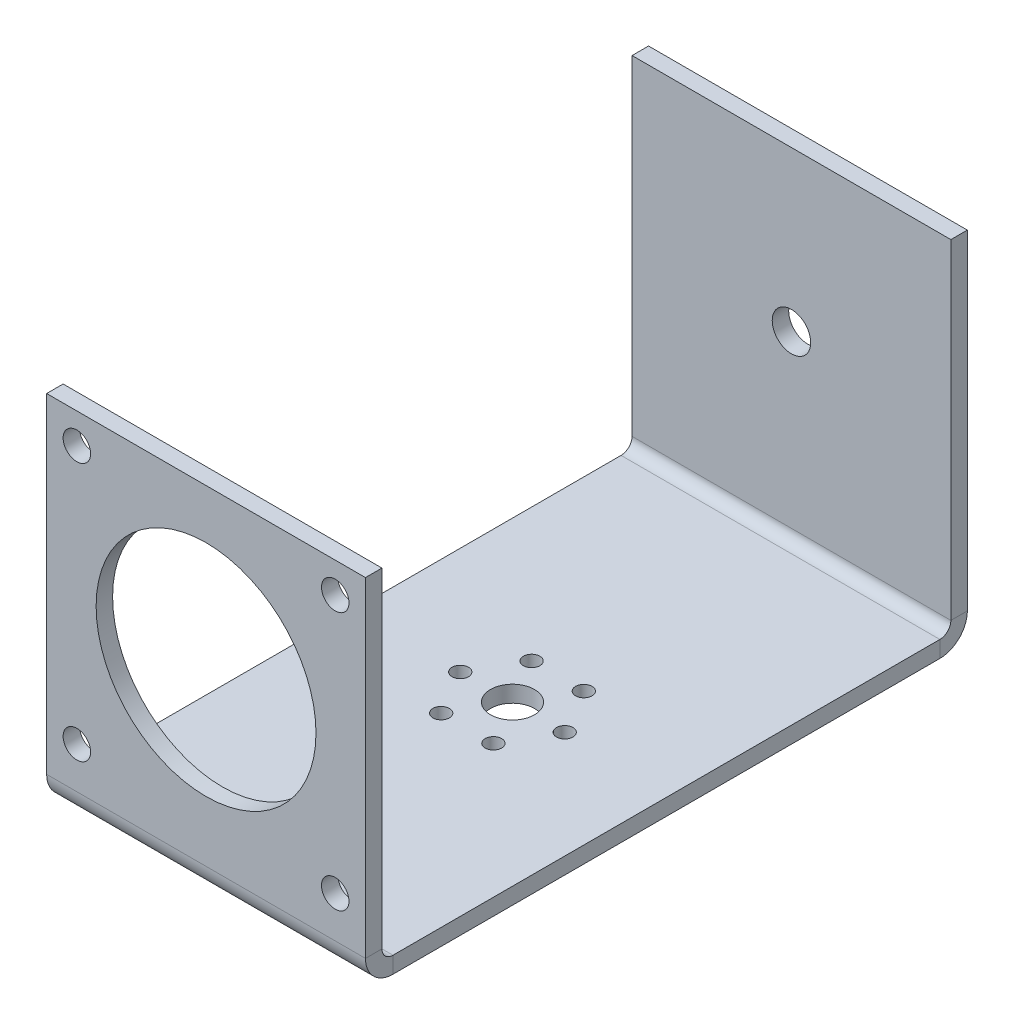
ISO-10303-21;
HEADER;
FILE_DESCRIPTION(('STEP AP214'),'2;1');
FILE_NAME('part.step','',(''),(''),'','','');
FILE_SCHEMA(('AUTOMOTIVE_DESIGN { 1 0 10303 214 1 1 1 1 }'));
ENDSEC;
DATA;
#1=APPLICATION_CONTEXT('core data for automotive mechanical design processes');
#2=APPLICATION_PROTOCOL_DEFINITION('international standard','automotive_design',2000,#1);
#3=PRODUCT_CONTEXT('',#1,'mechanical');
#4=PRODUCT('Part','Part','',(#3));
#5=PRODUCT_RELATED_PRODUCT_CATEGORY('part','',(#4));
#6=PRODUCT_DEFINITION_FORMATION('','',#4);
#7=PRODUCT_DEFINITION_CONTEXT('part definition',#1,'design');
#8=PRODUCT_DEFINITION('design','',#6,#7);
#9=PRODUCT_DEFINITION_SHAPE('','',#8);
#10=(LENGTH_UNIT() NAMED_UNIT(*) SI_UNIT(.MILLI.,.METRE.));
#11=(NAMED_UNIT(*) PLANE_ANGLE_UNIT() SI_UNIT($,.RADIAN.));
#12=(NAMED_UNIT(*) SI_UNIT($,.STERADIAN.) SOLID_ANGLE_UNIT());
#13=UNCERTAINTY_MEASURE_WITH_UNIT(LENGTH_MEASURE(1.E-05),#10,'distance_accuracy_value','');
#14=(GEOMETRIC_REPRESENTATION_CONTEXT(3) GLOBAL_UNCERTAINTY_ASSIGNED_CONTEXT((#13)) GLOBAL_UNIT_ASSIGNED_CONTEXT((#10,
#11,#12)) REPRESENTATION_CONTEXT('',''));
#15=CARTESIAN_POINT('',(0.,0.,0.));
#16=DIRECTION('',(0.,0.,1.));
#17=DIRECTION('',(1.,0.,0.));
#18=AXIS2_PLACEMENT_3D('',#15,#16,#17);
#19=CARTESIAN_POINT('',(0.,-31.5991903846266,0.));
#20=DIRECTION('',(1.,0.,0.));
#21=DIRECTION('',(0.,0.,1.));
#22=AXIS2_PLACEMENT_3D('',#19,#20,#21);
#23=PLANE('',#22);
#24=DIRECTION('',(0.,1.,0.));
#25=VECTOR('',#24,1.);
#26=CARTESIAN_POINT('',(0.,-31.5991903846266,-28.1483281173427));
#27=LINE('',#26,#25);
#28=CARTESIAN_POINT('',(0.,-34.5991903846266,-28.1483281173427));
#29=VERTEX_POINT('',#28);
#30=CARTESIAN_POINT('',(0.,-31.5991903846266,-28.1483281173427));
#31=VERTEX_POINT('',#30);
#32=EDGE_CURVE('E11',#29,#31,#27,.T.);
#33=ORIENTED_EDGE('',*,*,#32,.F.);
#34=DIRECTION('',(0.,0.,-1.));
#35=VECTOR('',#34,1.);
#36=CARTESIAN_POINT('',(0.,-34.5991903846266,73.3516718826573));
#37=LINE('',#36,#35);
#38=CARTESIAN_POINT('',(0.,-34.5991903846266,71.3516718826573));
#39=VERTEX_POINT('',#38);
#40=EDGE_CURVE('E99',#29,#39,#37,.F.);
#41=ORIENTED_EDGE('',*,*,#40,.T.);
#42=DIRECTION('',(0.,1.,0.));
#43=VECTOR('',#42,1.);
#44=CARTESIAN_POINT('',(0.,-31.5991903846266,71.3516718826573));
#45=LINE('',#44,#43);
#46=CARTESIAN_POINT('',(0.,-31.5991903846266,71.3516718826573));
#47=VERTEX_POINT('',#46);
#48=EDGE_CURVE('E47',#39,#47,#45,.T.);
#49=ORIENTED_EDGE('',*,*,#48,.T.);
#50=DIRECTION('',(0.,0.,1.));
#51=VECTOR('',#50,1.);
#52=CARTESIAN_POINT('',(0.,-31.5991903846266,0.));
#53=LINE('',#52,#51);
#54=EDGE_CURVE('E102',#31,#47,#53,.T.);
#55=ORIENTED_EDGE('',*,*,#54,.F.);
#56=EDGE_LOOP('',(#33,#41,#49,#55));
#57=FACE_BOUND('',#56,.T.);
#58=ADVANCED_FACE('F37',(#57),#23,.F.);
#59=CARTESIAN_POINT('',(0.,-29.5991903846266,71.3516718826573));
#60=DIRECTION('',(-1.,0.,0.));
#61=DIRECTION('',(0.,0.,1.));
#62=AXIS2_PLACEMENT_3D('',#59,#60,#61);
#63=PLANE('',#62);
#64=ORIENTED_EDGE('',*,*,#48,.F.);
#65=CARTESIAN_POINT('',(0.,-29.5991903846266,71.3516718826573));
#66=DIRECTION('',(-1.,0.,0.));
#67=DIRECTION('',(0.,0.,1.));
#68=AXIS2_PLACEMENT_3D('',#65,#66,#67);
#69=CIRCLE('',#68,5.);
#70=CARTESIAN_POINT('',(0.,-29.5991903846266,76.3516718826573));
#71=VERTEX_POINT('',#70);
#72=EDGE_CURVE('E142',#39,#71,#69,.T.);
#73=ORIENTED_EDGE('',*,*,#72,.T.);
#74=DIRECTION('',(0.,0.,-1.));
#75=VECTOR('',#74,1.);
#76=CARTESIAN_POINT('',(0.,-29.5991903846266,73.3516718826573));
#77=LINE('',#76,#75);
#78=CARTESIAN_POINT('',(0.,-29.5991903846266,73.3516718826573));
#79=VERTEX_POINT('',#78);
#80=EDGE_CURVE('E185',#71,#79,#77,.T.);
#81=ORIENTED_EDGE('',*,*,#80,.T.);
#82=CARTESIAN_POINT('',(0.,-29.5991903846266,71.3516718826573));
#83=DIRECTION('',(1.,0.,0.));
#84=DIRECTION('',(0.,0.,-1.));
#85=AXIS2_PLACEMENT_3D('',#82,#83,#84);
#86=CIRCLE('',#85,2.);
#87=EDGE_CURVE('E204',#47,#79,#86,.F.);
#88=ORIENTED_EDGE('',*,*,#87,.F.);
#89=EDGE_LOOP('',(#64,#73,#81,#88));
#90=FACE_BOUND('',#89,.T.);
#91=ADVANCED_FACE('F205',(#90),#63,.T.);
#92=CARTESIAN_POINT('',(0.,30.4008096153734,73.3516718826573));
#93=DIRECTION('',(1.,0.,0.));
#94=DIRECTION('',(0.,1.,0.));
#95=AXIS2_PLACEMENT_3D('',#92,#93,#94);
#96=PLANE('',#95);
#97=ORIENTED_EDGE('',*,*,#80,.F.);
#98=DIRECTION('',(0.,-1.,0.));
#99=VECTOR('',#98,1.);
#100=CARTESIAN_POINT('',(0.,30.4008096153734,76.3516718826573));
#101=LINE('',#100,#99);
#102=CARTESIAN_POINT('',(0.,30.4008096153734,76.3516718826573));
#103=VERTEX_POINT('',#102);
#104=EDGE_CURVE('E162',#71,#103,#101,.F.);
#105=ORIENTED_EDGE('',*,*,#104,.T.);
#106=DIRECTION('',(0.,0.,-1.));
#107=VECTOR('',#106,1.);
#108=CARTESIAN_POINT('',(0.,30.4008096153734,73.3516718826573));
#109=LINE('',#108,#107);
#110=CARTESIAN_POINT('',(0.,30.4008096153734,73.3516718826573));
#111=VERTEX_POINT('',#110);
#112=EDGE_CURVE('E182',#103,#111,#109,.T.);
#113=ORIENTED_EDGE('',*,*,#112,.T.);
#114=DIRECTION('',(0.,1.,0.));
#115=VECTOR('',#114,1.);
#116=CARTESIAN_POINT('',(0.,30.4008096153734,73.3516718826573));
#117=LINE('',#116,#115);
#118=EDGE_CURVE('E263',#79,#111,#117,.T.);
#119=ORIENTED_EDGE('',*,*,#118,.F.);
#120=EDGE_LOOP('',(#97,#105,#113,#119));
#121=FACE_BOUND('',#120,.T.);
#122=ADVANCED_FACE('F261',(#121),#96,.F.);
#123=CARTESIAN_POINT('',(58.,30.4008096153734,73.3516718826573));
#124=DIRECTION('',(0.,1.,0.));
#125=DIRECTION('',(-1.,0.,0.));
#126=AXIS2_PLACEMENT_3D('',#123,#124,#125);
#127=PLANE('',#126);
#128=ORIENTED_EDGE('',*,*,#112,.F.);
#129=DIRECTION('',(1.,0.,0.));
#130=VECTOR('',#129,1.);
#131=CARTESIAN_POINT('',(58.,30.4008096153734,76.3516718826573));
#132=LINE('',#131,#130);
#133=CARTESIAN_POINT('',(58.,30.4008096153734,76.3516718826573));
#134=VERTEX_POINT('',#133);
#135=EDGE_CURVE('E248',#134,#103,#132,.F.);
#136=ORIENTED_EDGE('',*,*,#135,.F.);
#137=DIRECTION('',(0.,0.,-1.));
#138=VECTOR('',#137,1.);
#139=CARTESIAN_POINT('',(58.,30.4008096153734,73.3516718826573));
#140=LINE('',#139,#138);
#141=CARTESIAN_POINT('',(58.,30.4008096153734,73.3516718826573));
#142=VERTEX_POINT('',#141);
#143=EDGE_CURVE('E179',#134,#142,#140,.T.);
#144=ORIENTED_EDGE('',*,*,#143,.T.);
#145=DIRECTION('',(-1.,0.,0.));
#146=VECTOR('',#145,1.);
#147=CARTESIAN_POINT('',(58.,30.4008096153734,73.3516718826573));
#148=LINE('',#147,#146);
#149=EDGE_CURVE('E267',#142,#111,#148,.T.);
#150=ORIENTED_EDGE('',*,*,#149,.T.);
#151=EDGE_LOOP('',(#128,#136,#144,#150));
#152=FACE_BOUND('',#151,.T.);
#153=ADVANCED_FACE('F418',(#152),#127,.T.);
#154=CARTESIAN_POINT('',(58.,30.4008096153734,73.3516718826573));
#155=DIRECTION('',(1.,0.,0.));
#156=DIRECTION('',(0.,1.,0.));
#157=AXIS2_PLACEMENT_3D('',#154,#155,#156);
#158=PLANE('',#157);
#159=ORIENTED_EDGE('',*,*,#143,.F.);
#160=DIRECTION('',(0.,-1.,0.));
#161=VECTOR('',#160,1.);
#162=CARTESIAN_POINT('',(58.,30.4008096153734,76.3516718826573));
#163=LINE('',#162,#161);
#164=CARTESIAN_POINT('',(58.,-29.5991903846266,76.3516718826573));
#165=VERTEX_POINT('',#164);
#166=EDGE_CURVE('E236',#165,#134,#163,.F.);
#167=ORIENTED_EDGE('',*,*,#166,.F.);
#168=DIRECTION('',(0.,0.,-1.));
#169=VECTOR('',#168,1.);
#170=CARTESIAN_POINT('',(58.,-29.5991903846266,73.3516718826573));
#171=LINE('',#170,#169);
#172=CARTESIAN_POINT('',(58.,-29.5991903846266,73.3516718826573));
#173=VERTEX_POINT('',#172);
#174=EDGE_CURVE('E55',#165,#173,#171,.T.);
#175=ORIENTED_EDGE('',*,*,#174,.T.);
#176=DIRECTION('',(0.,1.,0.));
#177=VECTOR('',#176,1.);
#178=CARTESIAN_POINT('',(58.,30.4008096153734,73.3516718826573));
#179=LINE('',#178,#177);
#180=EDGE_CURVE('E271',#173,#142,#179,.T.);
#181=ORIENTED_EDGE('',*,*,#180,.T.);
#182=EDGE_LOOP('',(#159,#167,#175,#181));
#183=FACE_BOUND('',#182,.T.);
#184=ADVANCED_FACE('F415',(#183),#158,.T.);
#185=CARTESIAN_POINT('',(58.,-29.5991903846266,71.3516718826573));
#186=DIRECTION('',(-1.,0.,0.));
#187=DIRECTION('',(0.,0.,1.));
#188=AXIS2_PLACEMENT_3D('',#185,#186,#187);
#189=PLANE('',#188);
#190=ORIENTED_EDGE('',*,*,#174,.F.);
#191=CARTESIAN_POINT('',(58.,-29.5991903846266,71.3516718826573));
#192=DIRECTION('',(-1.,0.,0.));
#193=DIRECTION('',(0.,0.,1.));
#194=AXIS2_PLACEMENT_3D('',#191,#192,#193);
#195=CIRCLE('',#194,5.);
#196=CARTESIAN_POINT('',(58.,-34.5991903846266,71.3516718826573));
#197=VERTEX_POINT('',#196);
#198=EDGE_CURVE('E242',#165,#197,#195,.F.);
#199=ORIENTED_EDGE('',*,*,#198,.T.);
#200=DIRECTION('',(0.,1.,0.));
#201=VECTOR('',#200,1.);
#202=CARTESIAN_POINT('',(58.,-31.5991903846266,71.3516718826573));
#203=LINE('',#202,#201);
#204=CARTESIAN_POINT('',(58.,-31.5991903846266,71.3516718826573));
#205=VERTEX_POINT('',#204);
#206=EDGE_CURVE('E175',#197,#205,#203,.T.);
#207=ORIENTED_EDGE('',*,*,#206,.T.);
#208=CARTESIAN_POINT('',(58.,-29.5991903846266,71.3516718826573));
#209=DIRECTION('',(1.,0.,0.));
#210=DIRECTION('',(0.,0.,-1.));
#211=AXIS2_PLACEMENT_3D('',#208,#209,#210);
#212=CIRCLE('',#211,2.);
#213=EDGE_CURVE('E210',#173,#205,#212,.T.);
#214=ORIENTED_EDGE('',*,*,#213,.F.);
#215=EDGE_LOOP('',(#190,#199,#207,#214));
#216=FACE_BOUND('',#215,.T.);
#217=ADVANCED_FACE('F276',(#216),#189,.F.);
#218=CARTESIAN_POINT('',(58.,-31.5991903846266,73.3516718826573));
#219=DIRECTION('',(-1.,0.,0.));
#220=DIRECTION('',(0.,0.,-1.));
#221=AXIS2_PLACEMENT_3D('',#218,#219,#220);
#222=PLANE('',#221);
#223=ORIENTED_EDGE('',*,*,#206,.F.);
#224=DIRECTION('',(0.,0.,-1.));
#225=VECTOR('',#224,1.);
#226=CARTESIAN_POINT('',(58.,-34.5991903846266,73.3516718826573));
#227=LINE('',#226,#225);
#228=CARTESIAN_POINT('',(58.,-34.5991903846266,-28.1483281173427));
#229=VERTEX_POINT('',#228);
#230=EDGE_CURVE('E130',#197,#229,#227,.T.);
#231=ORIENTED_EDGE('',*,*,#230,.T.);
#232=DIRECTION('',(0.,1.,0.));
#233=VECTOR('',#232,1.);
#234=CARTESIAN_POINT('',(58.,-31.5991903846266,-28.1483281173427));
#235=LINE('',#234,#233);
#236=CARTESIAN_POINT('',(58.,-31.5991903846266,-28.1483281173427));
#237=VERTEX_POINT('',#236);
#238=EDGE_CURVE('E172',#229,#237,#235,.T.);
#239=ORIENTED_EDGE('',*,*,#238,.T.);
#240=DIRECTION('',(0.,0.,-1.));
#241=VECTOR('',#240,1.);
#242=CARTESIAN_POINT('',(58.,-31.5991903846266,73.3516718826573));
#243=LINE('',#242,#241);
#244=EDGE_CURVE('E200',#205,#237,#243,.T.);
#245=ORIENTED_EDGE('',*,*,#244,.F.);
#246=EDGE_LOOP('',(#223,#231,#239,#245));
#247=FACE_BOUND('',#246,.T.);
#248=ADVANCED_FACE('F280',(#247),#222,.F.);
#249=CARTESIAN_POINT('',(58.,-29.5991903846266,-28.1483281173427));
#250=DIRECTION('',(-1.,0.,0.));
#251=DIRECTION('',(0.,0.,1.));
#252=AXIS2_PLACEMENT_3D('',#249,#250,#251);
#253=PLANE('',#252);
#254=ORIENTED_EDGE('',*,*,#238,.F.);
#255=CARTESIAN_POINT('',(58.,-29.5991903846266,-28.1483281173427));
#256=DIRECTION('',(-1.,0.,0.));
#257=DIRECTION('',(0.,0.,1.));
#258=AXIS2_PLACEMENT_3D('',#255,#256,#257);
#259=CIRCLE('',#258,5.);
#260=CARTESIAN_POINT('',(58.,-29.5991903846266,-33.1483281173427));
#261=VERTEX_POINT('',#260);
#262=EDGE_CURVE('E118',#229,#261,#259,.F.);
#263=ORIENTED_EDGE('',*,*,#262,.T.);
#264=DIRECTION('',(0.,0.,1.));
#265=VECTOR('',#264,1.);
#266=CARTESIAN_POINT('',(58.,-29.5991903846266,-30.1483281173427));
#267=LINE('',#266,#265);
#268=CARTESIAN_POINT('',(58.,-29.5991903846266,-30.1483281173427));
#269=VERTEX_POINT('',#268);
#270=EDGE_CURVE('E169',#261,#269,#267,.T.);
#271=ORIENTED_EDGE('',*,*,#270,.T.);
#272=CARTESIAN_POINT('',(58.,-29.5991903846266,-28.1483281173427));
#273=DIRECTION('',(1.,0.,0.));
#274=DIRECTION('',(0.,0.,-1.));
#275=AXIS2_PLACEMENT_3D('',#272,#273,#274);
#276=CIRCLE('',#275,2.);
#277=EDGE_CURVE('E209',#237,#269,#276,.T.);
#278=ORIENTED_EDGE('',*,*,#277,.F.);
#279=EDGE_LOOP('',(#254,#263,#271,#278));
#280=FACE_BOUND('',#279,.T.);
#281=ADVANCED_FACE('F406',(#280),#253,.F.);
#282=CARTESIAN_POINT('',(58.,-29.5991903846266,-30.1483281173427));
#283=DIRECTION('',(1.,0.,0.));
#284=DIRECTION('',(0.,-1.,0.));
#285=AXIS2_PLACEMENT_3D('',#282,#283,#284);
#286=PLANE('',#285);
#287=ORIENTED_EDGE('',*,*,#270,.F.);
#288=DIRECTION('',(0.,1.,0.));
#289=VECTOR('',#288,1.);
#290=CARTESIAN_POINT('',(58.,-29.5991903846266,-33.1483281173427));
#291=LINE('',#290,#289);
#292=CARTESIAN_POINT('',(58.,30.4008096153734,-33.1483281173427));
#293=VERTEX_POINT('',#292);
#294=EDGE_CURVE('E235',#293,#261,#291,.F.);
#295=ORIENTED_EDGE('',*,*,#294,.F.);
#296=DIRECTION('',(0.,0.,1.));
#297=VECTOR('',#296,1.);
#298=CARTESIAN_POINT('',(58.,30.4008096153734,-30.1483281173427));
#299=LINE('',#298,#297);
#300=CARTESIAN_POINT('',(58.,30.4008096153734,-30.1483281173427));
#301=VERTEX_POINT('',#300);
#302=EDGE_CURVE('E166',#293,#301,#299,.T.);
#303=ORIENTED_EDGE('',*,*,#302,.T.);
#304=DIRECTION('',(0.,-1.,0.));
#305=VECTOR('',#304,1.);
#306=CARTESIAN_POINT('',(58.,-29.5991903846266,-30.1483281173427));
#307=LINE('',#306,#305);
#308=EDGE_CURVE('E290',#301,#269,#307,.T.);
#309=ORIENTED_EDGE('',*,*,#308,.T.);
#310=EDGE_LOOP('',(#287,#295,#303,#309));
#311=FACE_BOUND('',#310,.T.);
#312=ADVANCED_FACE('F402',(#311),#286,.T.);
#313=CARTESIAN_POINT('',(58.,30.4008096153734,-30.1483281173427));
#314=DIRECTION('',(0.,-1.,0.));
#315=DIRECTION('',(-1.,0.,0.));
#316=AXIS2_PLACEMENT_3D('',#313,#314,#315);
#317=PLANE('',#316);
#318=ORIENTED_EDGE('',*,*,#302,.F.);
#319=DIRECTION('',(-1.,0.,0.));
#320=VECTOR('',#319,1.);
#321=CARTESIAN_POINT('',(58.,30.4008096153734,-33.1483281173427));
#322=LINE('',#321,#320);
#323=CARTESIAN_POINT('',(0.,30.4008096153734,-33.1483281173427));
#324=VERTEX_POINT('',#323);
#325=EDGE_CURVE('E228',#293,#324,#322,.T.);
#326=ORIENTED_EDGE('',*,*,#325,.T.);
#327=DIRECTION('',(0.,0.,1.));
#328=VECTOR('',#327,1.);
#329=CARTESIAN_POINT('',(0.,30.4008096153734,-30.1483281173427));
#330=LINE('',#329,#328);
#331=CARTESIAN_POINT('',(0.,30.4008096153734,-30.1483281173427));
#332=VERTEX_POINT('',#331);
#333=EDGE_CURVE('E163',#324,#332,#330,.T.);
#334=ORIENTED_EDGE('',*,*,#333,.T.);
#335=DIRECTION('',(-1.,0.,0.));
#336=VECTOR('',#335,1.);
#337=CARTESIAN_POINT('',(58.,30.4008096153734,-30.1483281173427));
#338=LINE('',#337,#336);
#339=EDGE_CURVE('E293',#301,#332,#338,.T.);
#340=ORIENTED_EDGE('',*,*,#339,.F.);
#341=EDGE_LOOP('',(#318,#326,#334,#340));
#342=FACE_BOUND('',#341,.T.);
#343=ADVANCED_FACE('F398',(#342),#317,.F.);
#344=CARTESIAN_POINT('',(0.,-29.5991903846266,-30.1483281173427));
#345=DIRECTION('',(1.,0.,0.));
#346=DIRECTION('',(0.,-1.,0.));
#347=AXIS2_PLACEMENT_3D('',#344,#345,#346);
#348=PLANE('',#347);
#349=ORIENTED_EDGE('',*,*,#333,.F.);
#350=DIRECTION('',(0.,1.,0.));
#351=VECTOR('',#350,1.);
#352=CARTESIAN_POINT('',(0.,-29.5991903846266,-33.1483281173427));
#353=LINE('',#352,#351);
#354=CARTESIAN_POINT('',(0.,-29.5991903846266,-33.1483281173427));
#355=VERTEX_POINT('',#354);
#356=EDGE_CURVE('E233',#324,#355,#353,.F.);
#357=ORIENTED_EDGE('',*,*,#356,.T.);
#358=DIRECTION('',(0.,0.,1.));
#359=VECTOR('',#358,1.);
#360=CARTESIAN_POINT('',(0.,-29.5991903846266,-30.1483281173427));
#361=LINE('',#360,#359);
#362=CARTESIAN_POINT('',(0.,-29.5991903846266,-30.1483281173427));
#363=VERTEX_POINT('',#362);
#364=EDGE_CURVE('E41',#355,#363,#361,.T.);
#365=ORIENTED_EDGE('',*,*,#364,.T.);
#366=DIRECTION('',(0.,-1.,0.));
#367=VECTOR('',#366,1.);
#368=CARTESIAN_POINT('',(0.,-29.5991903846266,-30.1483281173427));
#369=LINE('',#368,#367);
#370=EDGE_CURVE('E273',#332,#363,#369,.T.);
#371=ORIENTED_EDGE('',*,*,#370,.F.);
#372=EDGE_LOOP('',(#349,#357,#365,#371));
#373=FACE_BOUND('',#372,.T.);
#374=ADVANCED_FACE('F354',(#373),#348,.F.);
#375=CARTESIAN_POINT('',(24.2499999999999,-31.5991903846266,28.8289132186094));
#376=DIRECTION('',(0.,1.,0.));
#377=DIRECTION('',(0.,0.,1.));
#378=AXIS2_PLACEMENT_3D('',#375,#376,#377);
#379=CYLINDRICAL_SURFACE('',#378,1.50000000000001);
#380=CARTESIAN_POINT('',(24.2499999999999,-31.5991903846266,28.8289132186094));
#381=DIRECTION('',(0.,1.,0.));
#382=DIRECTION('',(0.,0.,1.));
#383=AXIS2_PLACEMENT_3D('',#380,#381,#382);
#384=CIRCLE('',#383,1.50000000000001);
#385=CARTESIAN_POINT('',(24.2499999999999,-31.5991903846266,30.3289132186094));
#386=VERTEX_POINT('',#385);
#387=EDGE_CURVE('E301',#386,#386,#384,.T.);
#388=ORIENTED_EDGE('',*,*,#387,.T.);
#389=EDGE_LOOP('',(#388));
#390=FACE_BOUND('',#389,.T.);
#391=CARTESIAN_POINT('',(24.2499999999999,-34.5991903846266,28.8289132186094));
#392=DIRECTION('',(0.,1.,0.));
#393=DIRECTION('',(0.,0.,1.));
#394=AXIS2_PLACEMENT_3D('',#391,#392,#393);
#395=CIRCLE('',#394,1.50000000000001);
#396=CARTESIAN_POINT('',(24.2499999999999,-34.5991903846266,30.3289132186094));
#397=VERTEX_POINT('',#396);
#398=EDGE_CURVE('E137',#397,#397,#395,.T.);
#399=ORIENTED_EDGE('',*,*,#398,.F.);
#400=EDGE_LOOP('',(#399));
#401=FACE_BOUND('',#400,.T.);
#402=ADVANCED_FACE('F350',(#390,#401),#379,.F.);
#403=CARTESIAN_POINT('',(33.7499999999999,-31.5991903846266,28.8289132186095));
#404=DIRECTION('',(0.,1.,0.));
#405=DIRECTION('',(0.,0.,1.));
#406=AXIS2_PLACEMENT_3D('',#403,#404,#405);
#407=CYLINDRICAL_SURFACE('',#406,1.5);
#408=CARTESIAN_POINT('',(33.7499999999999,-31.5991903846266,28.8289132186095));
#409=DIRECTION('',(0.,1.,0.));
#410=DIRECTION('',(0.,0.,1.));
#411=AXIS2_PLACEMENT_3D('',#408,#409,#410);
#412=CIRCLE('',#411,1.5);
#413=CARTESIAN_POINT('',(33.7499999999999,-31.5991903846266,30.3289132186095));
#414=VERTEX_POINT('',#413);
#415=EDGE_CURVE('E303',#414,#414,#412,.T.);
#416=ORIENTED_EDGE('',*,*,#415,.T.);
#417=EDGE_LOOP('',(#416));
#418=FACE_BOUND('',#417,.T.);
#419=CARTESIAN_POINT('',(33.7499999999999,-34.5991903846266,28.8289132186095));
#420=DIRECTION('',(0.,1.,0.));
#421=DIRECTION('',(0.,0.,1.));
#422=AXIS2_PLACEMENT_3D('',#419,#420,#421);
#423=CIRCLE('',#422,1.5);
#424=CARTESIAN_POINT('',(33.7499999999999,-34.5991903846266,30.3289132186095));
#425=VERTEX_POINT('',#424);
#426=EDGE_CURVE('E140',#425,#425,#423,.T.);
#427=ORIENTED_EDGE('',*,*,#426,.F.);
#428=EDGE_LOOP('',(#427));
#429=FACE_BOUND('',#428,.T.);
#430=ADVANCED_FACE('F353',(#418,#429),#407,.F.);
#431=CARTESIAN_POINT('',(38.5,-31.5991903846266,20.6016718826573));
#432=DIRECTION('',(0.,1.,0.));
#433=DIRECTION('',(0.,0.,1.));
#434=AXIS2_PLACEMENT_3D('',#431,#432,#433);
#435=CYLINDRICAL_SURFACE('',#434,1.49999999999999);
#436=CARTESIAN_POINT('',(38.5,-31.5991903846266,20.6016718826573));
#437=DIRECTION('',(0.,1.,0.));
#438=DIRECTION('',(0.,0.,1.));
#439=AXIS2_PLACEMENT_3D('',#436,#437,#438);
#440=CIRCLE('',#439,1.49999999999999);
#441=CARTESIAN_POINT('',(38.5,-31.5991903846266,22.1016718826573));
#442=VERTEX_POINT('',#441);
#443=EDGE_CURVE('E308',#442,#442,#440,.T.);
#444=ORIENTED_EDGE('',*,*,#443,.T.);
#445=EDGE_LOOP('',(#444));
#446=FACE_BOUND('',#445,.T.);
#447=CARTESIAN_POINT('',(38.5,-34.5991903846266,20.6016718826573));
#448=DIRECTION('',(0.,1.,0.));
#449=DIRECTION('',(0.,0.,1.));
#450=AXIS2_PLACEMENT_3D('',#447,#448,#449);
#451=CIRCLE('',#450,1.49999999999999);
#452=CARTESIAN_POINT('',(38.5,-34.5991903846266,22.1016718826573));
#453=VERTEX_POINT('',#452);
#454=EDGE_CURVE('E148',#453,#453,#451,.T.);
#455=ORIENTED_EDGE('',*,*,#454,.F.);
#456=EDGE_LOOP('',(#455));
#457=FACE_BOUND('',#456,.T.);
#458=ADVANCED_FACE('F357',(#446,#457),#435,.F.);
#459=CARTESIAN_POINT('',(33.7500000000001,-31.5991903846266,12.3744305467051));
#460=DIRECTION('',(0.,1.,0.));
#461=DIRECTION('',(0.,0.,1.));
#462=AXIS2_PLACEMENT_3D('',#459,#460,#461);
#463=CYLINDRICAL_SURFACE('',#462,1.5);
#464=CARTESIAN_POINT('',(33.7500000000001,-31.5991903846266,12.3744305467051));
#465=DIRECTION('',(0.,1.,0.));
#466=DIRECTION('',(0.,0.,1.));
#467=AXIS2_PLACEMENT_3D('',#464,#465,#466);
#468=CIRCLE('',#467,1.5);
#469=CARTESIAN_POINT('',(33.7500000000001,-31.5991903846266,13.8744305467051));
#470=VERTEX_POINT('',#469);
#471=EDGE_CURVE('E315',#470,#470,#468,.T.);
#472=ORIENTED_EDGE('',*,*,#471,.T.);
#473=EDGE_LOOP('',(#472));
#474=FACE_BOUND('',#473,.T.);
#475=CARTESIAN_POINT('',(33.7500000000001,-34.5991903846266,12.3744305467051));
#476=DIRECTION('',(0.,1.,0.));
#477=DIRECTION('',(0.,0.,1.));
#478=AXIS2_PLACEMENT_3D('',#475,#476,#477);
#479=CIRCLE('',#478,1.5);
#480=CARTESIAN_POINT('',(33.7500000000001,-34.5991903846266,13.8744305467051));
#481=VERTEX_POINT('',#480);
#482=EDGE_CURVE('E151',#481,#481,#479,.T.);
#483=ORIENTED_EDGE('',*,*,#482,.F.);
#484=EDGE_LOOP('',(#483));
#485=FACE_BOUND('',#484,.T.);
#486=ADVANCED_FACE('F361',(#474,#485),#463,.F.);
#487=CARTESIAN_POINT('',(24.25,-31.5991903846266,12.3744305467051));
#488=DIRECTION('',(0.,1.,0.));
#489=DIRECTION('',(0.,0.,1.));
#490=AXIS2_PLACEMENT_3D('',#487,#488,#489);
#491=CYLINDRICAL_SURFACE('',#490,1.5);
#492=CARTESIAN_POINT('',(24.25,-31.5991903846266,12.3744305467051));
#493=DIRECTION('',(0.,1.,0.));
#494=DIRECTION('',(0.,0.,1.));
#495=AXIS2_PLACEMENT_3D('',#492,#493,#494);
#496=CIRCLE('',#495,1.5);
#497=CARTESIAN_POINT('',(24.25,-31.5991903846266,13.8744305467051));
#498=VERTEX_POINT('',#497);
#499=EDGE_CURVE('E318',#498,#498,#496,.T.);
#500=ORIENTED_EDGE('',*,*,#499,.T.);
#501=EDGE_LOOP('',(#500));
#502=FACE_BOUND('',#501,.T.);
#503=CARTESIAN_POINT('',(24.25,-34.5991903846266,12.3744305467051));
#504=DIRECTION('',(0.,1.,0.));
#505=DIRECTION('',(0.,0.,1.));
#506=AXIS2_PLACEMENT_3D('',#503,#504,#505);
#507=CIRCLE('',#506,1.5);
#508=CARTESIAN_POINT('',(24.25,-34.5991903846266,13.8744305467051));
#509=VERTEX_POINT('',#508);
#510=EDGE_CURVE('E154',#509,#509,#507,.T.);
#511=ORIENTED_EDGE('',*,*,#510,.F.);
#512=EDGE_LOOP('',(#511));
#513=FACE_BOUND('',#512,.T.);
#514=ADVANCED_FACE('F365',(#502,#513),#491,.F.);
#515=CARTESIAN_POINT('',(19.5,-31.5991903846266,20.6016718826573));
#516=DIRECTION('',(0.,1.,0.));
#517=DIRECTION('',(0.,0.,1.));
#518=AXIS2_PLACEMENT_3D('',#515,#516,#517);
#519=CYLINDRICAL_SURFACE('',#518,1.5);
#520=CARTESIAN_POINT('',(19.5,-31.5991903846266,20.6016718826573));
#521=DIRECTION('',(0.,1.,0.));
#522=DIRECTION('',(0.,0.,1.));
#523=AXIS2_PLACEMENT_3D('',#520,#521,#522);
#524=CIRCLE('',#523,1.5);
#525=CARTESIAN_POINT('',(19.5,-31.5991903846266,22.1016718826573));
#526=VERTEX_POINT('',#525);
#527=EDGE_CURVE('E201',#526,#526,#524,.T.);
#528=ORIENTED_EDGE('',*,*,#527,.T.);
#529=EDGE_LOOP('',(#528));
#530=FACE_BOUND('',#529,.T.);
#531=CARTESIAN_POINT('',(19.5,-34.5991903846266,20.6016718826573));
#532=DIRECTION('',(0.,1.,0.));
#533=DIRECTION('',(0.,0.,1.));
#534=AXIS2_PLACEMENT_3D('',#531,#532,#533);
#535=CIRCLE('',#534,1.5);
#536=CARTESIAN_POINT('',(19.5,-34.5991903846266,22.1016718826573));
#537=VERTEX_POINT('',#536);
#538=EDGE_CURVE('E131',#537,#537,#535,.T.);
#539=ORIENTED_EDGE('',*,*,#538,.F.);
#540=EDGE_LOOP('',(#539));
#541=FACE_BOUND('',#540,.T.);
#542=ADVANCED_FACE('F323',(#530,#541),#519,.F.);
#543=CARTESIAN_POINT('',(29.,-31.5991903846266,20.6016718826573));
#544=DIRECTION('',(0.,-1.,0.));
#545=DIRECTION('',(0.,0.,-1.));
#546=AXIS2_PLACEMENT_3D('',#543,#544,#545);
#547=CYLINDRICAL_SURFACE('',#546,4.);
#548=CARTESIAN_POINT('',(29.,-31.5991903846266,20.6016718826573));
#549=DIRECTION('',(0.,-1.,0.));
#550=DIRECTION('',(0.,0.,-1.));
#551=AXIS2_PLACEMENT_3D('',#548,#549,#550);
#552=CIRCLE('',#551,4.);
#553=CARTESIAN_POINT('',(29.,-31.5991903846266,16.6016718826573));
#554=VERTEX_POINT('',#553);
#555=EDGE_CURVE('E268',#554,#554,#552,.F.);
#556=ORIENTED_EDGE('',*,*,#555,.T.);
#557=EDGE_LOOP('',(#556));
#558=FACE_BOUND('',#557,.T.);
#559=CARTESIAN_POINT('',(29.,-34.5991903846266,20.6016718826573));
#560=DIRECTION('',(0.,-1.,0.));
#561=DIRECTION('',(0.,0.,-1.));
#562=AXIS2_PLACEMENT_3D('',#559,#560,#561);
#563=CIRCLE('',#562,4.);
#564=CARTESIAN_POINT('',(29.,-34.5991903846266,16.6016718826573));
#565=VERTEX_POINT('',#564);
#566=EDGE_CURVE('E159',#565,#565,#563,.F.);
#567=ORIENTED_EDGE('',*,*,#566,.F.);
#568=EDGE_LOOP('',(#567));
#569=FACE_BOUND('',#568,.T.);
#570=ADVANCED_FACE('F39',(#558,#569),#547,.F.);
#571=CARTESIAN_POINT('',(0.,-29.5991903846266,-28.1483281173427));
#572=DIRECTION('',(-1.,0.,0.));
#573=DIRECTION('',(0.,0.,1.));
#574=AXIS2_PLACEMENT_3D('',#571,#572,#573);
#575=PLANE('',#574);
#576=CARTESIAN_POINT('',(0.,-29.5991903846266,-28.1483281173427));
#577=DIRECTION('',(-1.,0.,0.));
#578=DIRECTION('',(0.,0.,1.));
#579=AXIS2_PLACEMENT_3D('',#576,#577,#578);
#580=CIRCLE('',#579,5.);
#581=EDGE_CURVE('E115',#355,#29,#580,.T.);
#582=ORIENTED_EDGE('',*,*,#581,.T.);
#583=ORIENTED_EDGE('',*,*,#32,.T.);
#584=CARTESIAN_POINT('',(0.,-29.5991903846266,-28.1483281173427));
#585=DIRECTION('',(1.,0.,0.));
#586=DIRECTION('',(0.,0.,-1.));
#587=AXIS2_PLACEMENT_3D('',#584,#585,#586);
#588=CIRCLE('',#587,2.);
#589=EDGE_CURVE('E223',#363,#31,#588,.F.);
#590=ORIENTED_EDGE('',*,*,#589,.F.);
#591=ORIENTED_EDGE('',*,*,#364,.F.);
#592=EDGE_LOOP('',(#582,#583,#590,#591));
#593=FACE_BOUND('',#592,.T.);
#594=ADVANCED_FACE('F134',(#593),#575,.T.);
#595=CARTESIAN_POINT('',(58.,-29.5991903846266,-30.1483281173427));
#596=DIRECTION('',(0.,0.,-1.));
#597=DIRECTION('',(-1.,0.,0.));
#598=AXIS2_PLACEMENT_3D('',#595,#596,#597);
#599=PLANE('',#598);
#600=CARTESIAN_POINT('',(29.,1.40080961537344,-30.1483281173427));
#601=DIRECTION('',(0.,0.,-1.));
#602=DIRECTION('',(-1.,0.,0.));
#603=AXIS2_PLACEMENT_3D('',#600,#601,#602);
#604=CIRCLE('',#603,3.5);
#605=CARTESIAN_POINT('',(25.5,1.40080961537344,-30.1483281173427));
#606=VERTEX_POINT('',#605);
#607=EDGE_CURVE('E772',#606,#606,#604,.T.);
#608=ORIENTED_EDGE('',*,*,#607,.T.);
#609=EDGE_LOOP('',(#608));
#610=FACE_BOUND('',#609,.T.);
#611=ORIENTED_EDGE('',*,*,#370,.T.);
#612=DIRECTION('',(1.,0.,0.));
#613=VECTOR('',#612,1.);
#614=CARTESIAN_POINT('',(58.,-29.5991903846266,-30.1483281173427));
#615=LINE('',#614,#613);
#616=EDGE_CURVE('E220',#363,#269,#615,.T.);
#617=ORIENTED_EDGE('',*,*,#616,.T.);
#618=ORIENTED_EDGE('',*,*,#308,.F.);
#619=ORIENTED_EDGE('',*,*,#339,.T.);
#620=EDGE_LOOP('',(#611,#617,#618,#619));
#621=FACE_BOUND('',#620,.T.);
#622=ADVANCED_FACE('F335',(#610,#621),#599,.F.);
#623=CARTESIAN_POINT('',(58.,30.4008096153734,73.3516718826573));
#624=DIRECTION('',(0.,0.,1.));
#625=DIRECTION('',(0.,-1.,0.));
#626=AXIS2_PLACEMENT_3D('',#623,#624,#625);
#627=PLANE('',#626);
#628=CARTESIAN_POINT('',(29.,1.40080961537344,73.3516718826573));
#629=DIRECTION('',(0.,0.,1.));
#630=DIRECTION('',(0.,-1.,0.));
#631=AXIS2_PLACEMENT_3D('',#628,#629,#630);
#632=CIRCLE('',#631,20.);
#633=CARTESIAN_POINT('',(29.,-18.5991903846266,73.3516718826573));
#634=VERTEX_POINT('',#633);
#635=EDGE_CURVE('E776',#634,#634,#632,.T.);
#636=ORIENTED_EDGE('',*,*,#635,.T.);
#637=EDGE_LOOP('',(#636));
#638=FACE_BOUND('',#637,.T.);
#639=CARTESIAN_POINT('',(5.50000000000001,-22.0991903846266,73.3516718826573));
#640=DIRECTION('',(0.,0.,1.));
#641=DIRECTION('',(0.,-1.,0.));
#642=AXIS2_PLACEMENT_3D('',#639,#640,#641);
#643=CIRCLE('',#642,2.5);
#644=CARTESIAN_POINT('',(5.50000000000001,-24.5991903846266,73.3516718826573));
#645=VERTEX_POINT('',#644);
#646=EDGE_CURVE('E785',#645,#645,#643,.T.);
#647=ORIENTED_EDGE('',*,*,#646,.T.);
#648=EDGE_LOOP('',(#647));
#649=FACE_BOUND('',#648,.T.);
#650=CARTESIAN_POINT('',(52.5,-22.0991903846266,73.3516718826573));
#651=DIRECTION('',(0.,0.,1.));
#652=DIRECTION('',(0.,-1.,0.));
#653=AXIS2_PLACEMENT_3D('',#650,#651,#652);
#654=CIRCLE('',#653,2.5);
#655=CARTESIAN_POINT('',(52.5,-24.5991903846266,73.3516718826573));
#656=VERTEX_POINT('',#655);
#657=EDGE_CURVE('E791',#656,#656,#654,.T.);
#658=ORIENTED_EDGE('',*,*,#657,.T.);
#659=EDGE_LOOP('',(#658));
#660=FACE_BOUND('',#659,.T.);
#661=CARTESIAN_POINT('',(52.5,24.9008096153734,73.3516718826573));
#662=DIRECTION('',(0.,0.,1.));
#663=DIRECTION('',(0.,-1.,0.));
#664=AXIS2_PLACEMENT_3D('',#661,#662,#663);
#665=CIRCLE('',#664,2.5);
#666=CARTESIAN_POINT('',(52.5,22.4008096153734,73.3516718826573));
#667=VERTEX_POINT('',#666);
#668=EDGE_CURVE('E797',#667,#667,#665,.T.);
#669=ORIENTED_EDGE('',*,*,#668,.T.);
#670=EDGE_LOOP('',(#669));
#671=FACE_BOUND('',#670,.T.);
#672=CARTESIAN_POINT('',(5.5,24.9008096153734,73.3516718826573));
#673=DIRECTION('',(0.,0.,1.));
#674=DIRECTION('',(0.,-1.,0.));
#675=AXIS2_PLACEMENT_3D('',#672,#673,#674);
#676=CIRCLE('',#675,2.5);
#677=CARTESIAN_POINT('',(5.5,22.4008096153734,73.3516718826573));
#678=VERTEX_POINT('',#677);
#679=EDGE_CURVE('E245',#678,#678,#676,.T.);
#680=ORIENTED_EDGE('',*,*,#679,.T.);
#681=EDGE_LOOP('',(#680));
#682=FACE_BOUND('',#681,.T.);
#683=ORIENTED_EDGE('',*,*,#180,.F.);
#684=DIRECTION('',(1.,0.,0.));
#685=VECTOR('',#684,1.);
#686=CARTESIAN_POINT('',(0.,-29.5991903846266,73.3516718826573));
#687=LINE('',#686,#685);
#688=EDGE_CURVE('E216',#173,#79,#687,.F.);
#689=ORIENTED_EDGE('',*,*,#688,.T.);
#690=ORIENTED_EDGE('',*,*,#118,.T.);
#691=ORIENTED_EDGE('',*,*,#149,.F.);
#692=EDGE_LOOP('',(#683,#689,#690,#691));
#693=FACE_BOUND('',#692,.T.);
#694=ADVANCED_FACE('F270',(#638,#649,#660,#671,#682,#693),#627,.F.);
#695=CARTESIAN_POINT('',(-32.,-31.5991903846266,73.3516718826573));
#696=DIRECTION('',(0.,-1.,0.));
#697=DIRECTION('',(0.,0.,-1.));
#698=AXIS2_PLACEMENT_3D('',#695,#696,#697);
#699=PLANE('',#698);
#700=ORIENTED_EDGE('',*,*,#387,.F.);
#701=EDGE_LOOP('',(#700));
#702=FACE_BOUND('',#701,.T.);
#703=ORIENTED_EDGE('',*,*,#415,.F.);
#704=EDGE_LOOP('',(#703));
#705=FACE_BOUND('',#704,.T.);
#706=ORIENTED_EDGE('',*,*,#443,.F.);
#707=EDGE_LOOP('',(#706));
#708=FACE_BOUND('',#707,.T.);
#709=ORIENTED_EDGE('',*,*,#471,.F.);
#710=EDGE_LOOP('',(#709));
#711=FACE_BOUND('',#710,.T.);
#712=ORIENTED_EDGE('',*,*,#499,.F.);
#713=EDGE_LOOP('',(#712));
#714=FACE_BOUND('',#713,.T.);
#715=ORIENTED_EDGE('',*,*,#527,.F.);
#716=EDGE_LOOP('',(#715));
#717=FACE_BOUND('',#716,.T.);
#718=ORIENTED_EDGE('',*,*,#54,.T.);
#719=DIRECTION('',(1.,0.,0.));
#720=VECTOR('',#719,1.);
#721=CARTESIAN_POINT('',(58.,-31.5991903846266,71.3516718826573));
#722=LINE('',#721,#720);
#723=EDGE_CURVE('E197',#47,#205,#722,.T.);
#724=ORIENTED_EDGE('',*,*,#723,.T.);
#725=ORIENTED_EDGE('',*,*,#244,.T.);
#726=DIRECTION('',(1.,0.,0.));
#727=VECTOR('',#726,1.);
#728=CARTESIAN_POINT('',(0.,-31.5991903846266,-28.1483281173427));
#729=LINE('',#728,#727);
#730=EDGE_CURVE('E199',#237,#31,#729,.F.);
#731=ORIENTED_EDGE('',*,*,#730,.T.);
#732=EDGE_LOOP('',(#718,#724,#725,#731));
#733=FACE_BOUND('',#732,.T.);
#734=ORIENTED_EDGE('',*,*,#555,.F.);
#735=EDGE_LOOP('',(#734));
#736=FACE_BOUND('',#735,.T.);
#737=ADVANCED_FACE('F193',(#702,#705,#708,#711,#714,#717,#733,#736),#699,.F.);
#738=CARTESIAN_POINT('',(58.,-29.5991903846266,-28.1483281173427));
#739=DIRECTION('',(-1.,0.,0.));
#740=DIRECTION('',(0.,0.,1.));
#741=AXIS2_PLACEMENT_3D('',#738,#739,#740);
#742=CYLINDRICAL_SURFACE('',#741,2.);
#743=ORIENTED_EDGE('',*,*,#589,.T.);
#744=ORIENTED_EDGE('',*,*,#730,.F.);
#745=ORIENTED_EDGE('',*,*,#277,.T.);
#746=ORIENTED_EDGE('',*,*,#616,.F.);
#747=EDGE_LOOP('',(#743,#744,#745,#746));
#748=FACE_BOUND('',#747,.T.);
#749=ADVANCED_FACE('F327',(#748),#742,.F.);
#750=CARTESIAN_POINT('',(-32.,-29.5991903846266,71.3516718826573));
#751=DIRECTION('',(-1.,0.,0.));
#752=DIRECTION('',(0.,0.,1.));
#753=AXIS2_PLACEMENT_3D('',#750,#751,#752);
#754=CYLINDRICAL_SURFACE('',#753,2.);
#755=ORIENTED_EDGE('',*,*,#87,.T.);
#756=ORIENTED_EDGE('',*,*,#688,.F.);
#757=ORIENTED_EDGE('',*,*,#213,.T.);
#758=ORIENTED_EDGE('',*,*,#723,.F.);
#759=EDGE_LOOP('',(#755,#756,#757,#758));
#760=FACE_BOUND('',#759,.T.);
#761=ADVANCED_FACE('F213',(#760),#754,.F.);
#762=CARTESIAN_POINT('',(58.,-29.5991903846266,-33.1483281173427));
#763=DIRECTION('',(0.,0.,-1.));
#764=DIRECTION('',(-1.,0.,0.));
#765=AXIS2_PLACEMENT_3D('',#762,#763,#764);
#766=PLANE('',#765);
#767=CARTESIAN_POINT('',(29.,1.40080961537344,-33.1483281173427));
#768=DIRECTION('',(0.,0.,-1.));
#769=DIRECTION('',(-1.,0.,0.));
#770=AXIS2_PLACEMENT_3D('',#767,#768,#769);
#771=CIRCLE('',#770,3.5);
#772=CARTESIAN_POINT('',(25.5,1.40080961537344,-33.1483281173427));
#773=VERTEX_POINT('',#772);
#774=EDGE_CURVE('E769',#773,#773,#771,.T.);
#775=ORIENTED_EDGE('',*,*,#774,.F.);
#776=EDGE_LOOP('',(#775));
#777=FACE_BOUND('',#776,.T.);
#778=ORIENTED_EDGE('',*,*,#356,.F.);
#779=ORIENTED_EDGE('',*,*,#325,.F.);
#780=ORIENTED_EDGE('',*,*,#294,.T.);
#781=DIRECTION('',(-1.,0.,0.));
#782=VECTOR('',#781,1.);
#783=CARTESIAN_POINT('',(58.,-29.5991903846266,-33.1483281173427));
#784=LINE('',#783,#782);
#785=EDGE_CURVE('E123',#355,#261,#784,.F.);
#786=ORIENTED_EDGE('',*,*,#785,.F.);
#787=EDGE_LOOP('',(#778,#779,#780,#786));
#788=FACE_BOUND('',#787,.T.);
#789=ADVANCED_FACE('F387',(#777,#788),#766,.T.);
#790=CARTESIAN_POINT('',(58.,30.4008096153734,76.3516718826573));
#791=DIRECTION('',(0.,0.,1.));
#792=DIRECTION('',(0.,-1.,0.));
#793=AXIS2_PLACEMENT_3D('',#790,#791,#792);
#794=PLANE('',#793);
#795=CARTESIAN_POINT('',(29.,1.40080961537344,76.3516718826573));
#796=DIRECTION('',(0.,0.,1.));
#797=DIRECTION('',(1.,0.,0.));
#798=AXIS2_PLACEMENT_3D('',#795,#796,#797);
#799=CIRCLE('',#798,20.);
#800=CARTESIAN_POINT('',(49.,1.40080961537344,76.3516718826573));
#801=VERTEX_POINT('',#800);
#802=EDGE_CURVE('E773',#801,#801,#799,.T.);
#803=ORIENTED_EDGE('',*,*,#802,.F.);
#804=EDGE_LOOP('',(#803));
#805=FACE_BOUND('',#804,.T.);
#806=CARTESIAN_POINT('',(5.50000000000001,-22.0991903846266,76.3516718826573));
#807=DIRECTION('',(0.,0.,1.));
#808=DIRECTION('',(-1.,0.,0.));
#809=AXIS2_PLACEMENT_3D('',#806,#807,#808);
#810=CIRCLE('',#809,2.5);
#811=CARTESIAN_POINT('',(3.00000000000001,-22.0991903846266,76.3516718826573));
#812=VERTEX_POINT('',#811);
#813=EDGE_CURVE('E782',#812,#812,#810,.T.);
#814=ORIENTED_EDGE('',*,*,#813,.F.);
#815=EDGE_LOOP('',(#814));
#816=FACE_BOUND('',#815,.T.);
#817=CARTESIAN_POINT('',(52.5,-22.0991903846266,76.3516718826573));
#818=DIRECTION('',(0.,0.,1.));
#819=DIRECTION('',(1.,0.,0.));
#820=AXIS2_PLACEMENT_3D('',#817,#818,#819);
#821=CIRCLE('',#820,2.5);
#822=CARTESIAN_POINT('',(55.,-22.0991903846266,76.3516718826573));
#823=VERTEX_POINT('',#822);
#824=EDGE_CURVE('E788',#823,#823,#821,.T.);
#825=ORIENTED_EDGE('',*,*,#824,.F.);
#826=EDGE_LOOP('',(#825));
#827=FACE_BOUND('',#826,.T.);
#828=CARTESIAN_POINT('',(52.5,24.9008096153734,76.3516718826573));
#829=DIRECTION('',(0.,0.,1.));
#830=DIRECTION('',(-1.,0.,0.));
#831=AXIS2_PLACEMENT_3D('',#828,#829,#830);
#832=CIRCLE('',#831,2.5);
#833=CARTESIAN_POINT('',(50.,24.9008096153734,76.3516718826573));
#834=VERTEX_POINT('',#833);
#835=EDGE_CURVE('E794',#834,#834,#832,.T.);
#836=ORIENTED_EDGE('',*,*,#835,.F.);
#837=EDGE_LOOP('',(#836));
#838=FACE_BOUND('',#837,.T.);
#839=CARTESIAN_POINT('',(5.5,24.9008096153734,76.3516718826573));
#840=DIRECTION('',(0.,0.,1.));
#841=DIRECTION('',(1.,0.,0.));
#842=AXIS2_PLACEMENT_3D('',#839,#840,#841);
#843=CIRCLE('',#842,2.5);
#844=CARTESIAN_POINT('',(8.,24.9008096153734,76.3516718826573));
#845=VERTEX_POINT('',#844);
#846=EDGE_CURVE('E799',#845,#845,#843,.T.);
#847=ORIENTED_EDGE('',*,*,#846,.F.);
#848=EDGE_LOOP('',(#847));
#849=FACE_BOUND('',#848,.T.);
#850=ORIENTED_EDGE('',*,*,#166,.T.);
#851=ORIENTED_EDGE('',*,*,#135,.T.);
#852=ORIENTED_EDGE('',*,*,#104,.F.);
#853=DIRECTION('',(1.,0.,0.));
#854=VECTOR('',#853,1.);
#855=CARTESIAN_POINT('',(58.,-29.5991903846266,76.3516718826573));
#856=LINE('',#855,#854);
#857=EDGE_CURVE('E226',#165,#71,#856,.F.);
#858=ORIENTED_EDGE('',*,*,#857,.F.);
#859=EDGE_LOOP('',(#850,#851,#852,#858));
#860=FACE_BOUND('',#859,.T.);
#861=ADVANCED_FACE('F258',(#805,#816,#827,#838,#849,#860),#794,.T.);
#862=CARTESIAN_POINT('',(-32.,-34.5991903846266,73.3516718826573));
#863=DIRECTION('',(0.,-1.,0.));
#864=DIRECTION('',(0.,0.,-1.));
#865=AXIS2_PLACEMENT_3D('',#862,#863,#864);
#866=PLANE('',#865);
#867=ORIENTED_EDGE('',*,*,#398,.T.);
#868=EDGE_LOOP('',(#867));
#869=FACE_BOUND('',#868,.T.);
#870=ORIENTED_EDGE('',*,*,#426,.T.);
#871=EDGE_LOOP('',(#870));
#872=FACE_BOUND('',#871,.T.);
#873=ORIENTED_EDGE('',*,*,#454,.T.);
#874=EDGE_LOOP('',(#873));
#875=FACE_BOUND('',#874,.T.);
#876=ORIENTED_EDGE('',*,*,#482,.T.);
#877=EDGE_LOOP('',(#876));
#878=FACE_BOUND('',#877,.T.);
#879=ORIENTED_EDGE('',*,*,#510,.T.);
#880=EDGE_LOOP('',(#879));
#881=FACE_BOUND('',#880,.T.);
#882=ORIENTED_EDGE('',*,*,#538,.T.);
#883=EDGE_LOOP('',(#882));
#884=FACE_BOUND('',#883,.T.);
#885=ORIENTED_EDGE('',*,*,#40,.F.);
#886=DIRECTION('',(1.,0.,0.));
#887=VECTOR('',#886,1.);
#888=CARTESIAN_POINT('',(-32.,-34.5991903846266,-28.1483281173427));
#889=LINE('',#888,#887);
#890=EDGE_CURVE('E112',#229,#29,#889,.F.);
#891=ORIENTED_EDGE('',*,*,#890,.F.);
#892=ORIENTED_EDGE('',*,*,#230,.F.);
#893=DIRECTION('',(1.,0.,0.));
#894=VECTOR('',#893,1.);
#895=CARTESIAN_POINT('',(-32.,-34.5991903846266,71.3516718826573));
#896=LINE('',#895,#894);
#897=EDGE_CURVE('E122',#39,#197,#896,.T.);
#898=ORIENTED_EDGE('',*,*,#897,.F.);
#899=EDGE_LOOP('',(#885,#891,#892,#898));
#900=FACE_BOUND('',#899,.T.);
#901=ORIENTED_EDGE('',*,*,#566,.T.);
#902=EDGE_LOOP('',(#901));
#903=FACE_BOUND('',#902,.T.);
#904=ADVANCED_FACE('F126',(#869,#872,#875,#878,#881,#884,#900,#903),#866,.T.);
#905=CARTESIAN_POINT('',(58.,-29.5991903846266,-28.1483281173427));
#906=DIRECTION('',(-1.,0.,0.));
#907=DIRECTION('',(0.,0.,1.));
#908=AXIS2_PLACEMENT_3D('',#905,#906,#907);
#909=CYLINDRICAL_SURFACE('',#908,5.);
#910=ORIENTED_EDGE('',*,*,#581,.F.);
#911=ORIENTED_EDGE('',*,*,#785,.T.);
#912=ORIENTED_EDGE('',*,*,#262,.F.);
#913=ORIENTED_EDGE('',*,*,#890,.T.);
#914=EDGE_LOOP('',(#910,#911,#912,#913));
#915=FACE_BOUND('',#914,.T.);
#916=ADVANCED_FACE('F113',(#915),#909,.T.);
#917=CARTESIAN_POINT('',(-32.,-29.5991903846266,71.3516718826573));
#918=DIRECTION('',(-1.,0.,0.));
#919=DIRECTION('',(0.,0.,1.));
#920=AXIS2_PLACEMENT_3D('',#917,#918,#919);
#921=CYLINDRICAL_SURFACE('',#920,5.);
#922=ORIENTED_EDGE('',*,*,#72,.F.);
#923=ORIENTED_EDGE('',*,*,#897,.T.);
#924=ORIENTED_EDGE('',*,*,#198,.F.);
#925=ORIENTED_EDGE('',*,*,#857,.T.);
#926=EDGE_LOOP('',(#922,#923,#924,#925));
#927=FACE_BOUND('',#926,.T.);
#928=ADVANCED_FACE('F253',(#927),#921,.T.);
#929=CARTESIAN_POINT('',(5.5,24.9008096153734,66.3516718826573));
#930=DIRECTION('',(0.,0.,1.));
#931=DIRECTION('',(1.,0.,0.));
#932=AXIS2_PLACEMENT_3D('',#929,#930,#931);
#933=CYLINDRICAL_SURFACE('',#932,2.5);
#934=ORIENTED_EDGE('',*,*,#846,.T.);
#935=EDGE_LOOP('',(#934));
#936=FACE_BOUND('',#935,.T.);
#937=ORIENTED_EDGE('',*,*,#679,.F.);
#938=EDGE_LOOP('',(#937));
#939=FACE_BOUND('',#938,.T.);
#940=ADVANCED_FACE('F395',(#936,#939),#933,.F.);
#941=CARTESIAN_POINT('',(52.5,24.9008096153734,66.3516718826573));
#942=DIRECTION('',(0.,0.,1.));
#943=DIRECTION('',(1.,0.,0.));
#944=AXIS2_PLACEMENT_3D('',#941,#942,#943);
#945=CYLINDRICAL_SURFACE('',#944,2.5);
#946=ORIENTED_EDGE('',*,*,#835,.T.);
#947=EDGE_LOOP('',(#946));
#948=FACE_BOUND('',#947,.T.);
#949=ORIENTED_EDGE('',*,*,#668,.F.);
#950=EDGE_LOOP('',(#949));
#951=FACE_BOUND('',#950,.T.);
#952=ADVANCED_FACE('F563',(#948,#951),#945,.F.);
#953=CARTESIAN_POINT('',(52.5,-22.0991903846266,66.3516718826573));
#954=DIRECTION('',(0.,0.,1.));
#955=DIRECTION('',(1.,0.,0.));
#956=AXIS2_PLACEMENT_3D('',#953,#954,#955);
#957=CYLINDRICAL_SURFACE('',#956,2.5);
#958=ORIENTED_EDGE('',*,*,#824,.T.);
#959=EDGE_LOOP('',(#958));
#960=FACE_BOUND('',#959,.T.);
#961=ORIENTED_EDGE('',*,*,#657,.F.);
#962=EDGE_LOOP('',(#961));
#963=FACE_BOUND('',#962,.T.);
#964=ADVANCED_FACE('F573',(#960,#963),#957,.F.);
#965=CARTESIAN_POINT('',(5.50000000000001,-22.0991903846266,66.3516718826573));
#966=DIRECTION('',(0.,0.,1.));
#967=DIRECTION('',(1.,0.,0.));
#968=AXIS2_PLACEMENT_3D('',#965,#966,#967);
#969=CYLINDRICAL_SURFACE('',#968,2.5);
#970=ORIENTED_EDGE('',*,*,#813,.T.);
#971=EDGE_LOOP('',(#970));
#972=FACE_BOUND('',#971,.T.);
#973=ORIENTED_EDGE('',*,*,#646,.F.);
#974=EDGE_LOOP('',(#973));
#975=FACE_BOUND('',#974,.T.);
#976=ADVANCED_FACE('F584',(#972,#975),#969,.F.);
#977=CARTESIAN_POINT('',(29.,1.40080961537344,66.3516718826573));
#978=DIRECTION('',(0.,0.,1.));
#979=DIRECTION('',(1.,0.,0.));
#980=AXIS2_PLACEMENT_3D('',#977,#978,#979);
#981=CYLINDRICAL_SURFACE('',#980,20.);
#982=ORIENTED_EDGE('',*,*,#802,.T.);
#983=EDGE_LOOP('',(#982));
#984=FACE_BOUND('',#983,.T.);
#985=ORIENTED_EDGE('',*,*,#635,.F.);
#986=EDGE_LOOP('',(#985));
#987=FACE_BOUND('',#986,.T.);
#988=ADVANCED_FACE('F595',(#984,#987),#981,.F.);
#989=CARTESIAN_POINT('',(29.,1.40080961537344,-23.1483281173427));
#990=DIRECTION('',(0.,0.,-1.));
#991=DIRECTION('',(-1.,0.,0.));
#992=AXIS2_PLACEMENT_3D('',#989,#990,#991);
#993=CYLINDRICAL_SURFACE('',#992,3.5);
#994=ORIENTED_EDGE('',*,*,#774,.T.);
#995=EDGE_LOOP('',(#994));
#996=FACE_BOUND('',#995,.T.);
#997=ORIENTED_EDGE('',*,*,#607,.F.);
#998=EDGE_LOOP('',(#997));
#999=FACE_BOUND('',#998,.T.);
#1000=ADVANCED_FACE('F606',(#996,#999),#993,.F.);
#1001=CLOSED_SHELL('',(#58,#91,#122,#153,#184,#217,#248,#281,#312,#343,#374,#402,#430,#458,#486,
#514,#542,#570,#594,#622,#694,#737,#749,#761,#789,#861,#904,#916,#928,#940,#952,#964,#976,#988,#1000));
#1002=MANIFOLD_SOLID_BREP('B2',#1001);
#1003=ADVANCED_BREP_SHAPE_REPRESENTATION('',(#18,#1002),#14);
#1004=SHAPE_DEFINITION_REPRESENTATION(#9,#1003);
ENDSEC;
END-ISO-10303-21;
